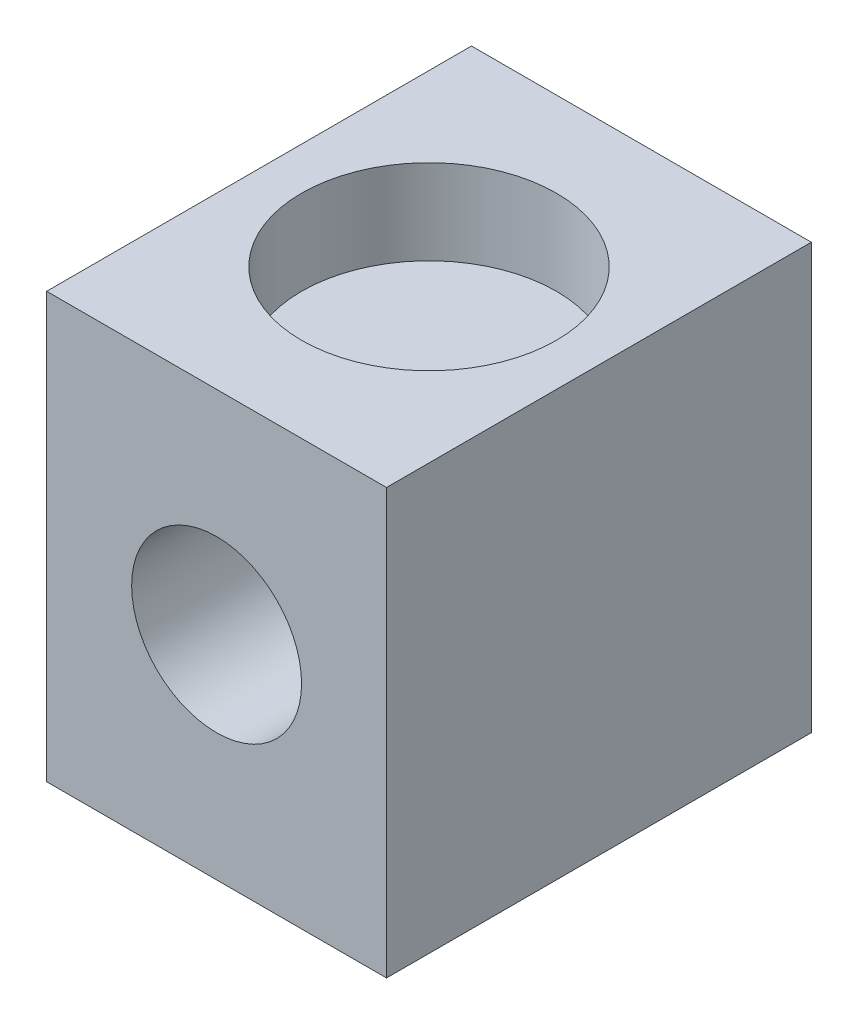
ISO-10303-21;
HEADER;
FILE_DESCRIPTION(('STEP AP214'),'2;1');
FILE_NAME('part.step','',(''),(''),'','','');
FILE_SCHEMA(('AUTOMOTIVE_DESIGN { 1 0 10303 214 1 1 1 1 }'));
ENDSEC;
DATA;
#1=APPLICATION_CONTEXT('core data for automotive mechanical design processes');
#2=APPLICATION_PROTOCOL_DEFINITION('international standard','automotive_design',2000,#1);
#3=PRODUCT_CONTEXT('',#1,'mechanical');
#4=PRODUCT('Part','Part','',(#3));
#5=PRODUCT_RELATED_PRODUCT_CATEGORY('part','',(#4));
#6=PRODUCT_DEFINITION_FORMATION('','',#4);
#7=PRODUCT_DEFINITION_CONTEXT('part definition',#1,'design');
#8=PRODUCT_DEFINITION('design','',#6,#7);
#9=PRODUCT_DEFINITION_SHAPE('','',#8);
#10=(LENGTH_UNIT() NAMED_UNIT(*) SI_UNIT(.MILLI.,.METRE.));
#11=(NAMED_UNIT(*) PLANE_ANGLE_UNIT() SI_UNIT($,.RADIAN.));
#12=(NAMED_UNIT(*) SI_UNIT($,.STERADIAN.) SOLID_ANGLE_UNIT());
#13=UNCERTAINTY_MEASURE_WITH_UNIT(LENGTH_MEASURE(1.E-05),#10,'distance_accuracy_value','');
#14=(GEOMETRIC_REPRESENTATION_CONTEXT(3) GLOBAL_UNCERTAINTY_ASSIGNED_CONTEXT((#13)) GLOBAL_UNIT_ASSIGNED_CONTEXT((#10,
#11,#12)) REPRESENTATION_CONTEXT('',''));
#15=CARTESIAN_POINT('',(0.,0.,0.));
#16=DIRECTION('',(0.,0.,1.));
#17=DIRECTION('',(1.,0.,0.));
#18=AXIS2_PLACEMENT_3D('',#15,#16,#17);
#19=CARTESIAN_POINT('',(0.,0.,5.));
#20=DIRECTION('',(0.,0.,-1.));
#21=DIRECTION('',(-1.,0.,0.));
#22=AXIS2_PLACEMENT_3D('',#19,#20,#21);
#23=PLANE('',#22);
#24=DIRECTION('',(0.,1.,0.));
#25=VECTOR('',#24,1.);
#26=CARTESIAN_POINT('',(2.,-2.5,5.));
#27=LINE('',#26,#25);
#28=CARTESIAN_POINT('',(2.,-2.5,5.));
#29=VERTEX_POINT('',#28);
#30=CARTESIAN_POINT('',(2.,2.5,5.));
#31=VERTEX_POINT('',#30);
#32=EDGE_CURVE('E92',#29,#31,#27,.T.);
#33=ORIENTED_EDGE('',*,*,#32,.T.);
#34=DIRECTION('',(-1.,0.,0.));
#35=VECTOR('',#34,1.);
#36=CARTESIAN_POINT('',(-2.,2.5,5.));
#37=LINE('',#36,#35);
#38=CARTESIAN_POINT('',(-2.,2.5,5.));
#39=VERTEX_POINT('',#38);
#40=EDGE_CURVE('E87',#31,#39,#37,.T.);
#41=ORIENTED_EDGE('',*,*,#40,.T.);
#42=DIRECTION('',(0.,-1.,0.));
#43=VECTOR('',#42,1.);
#44=CARTESIAN_POINT('',(-2.,-2.5,5.));
#45=LINE('',#44,#43);
#46=CARTESIAN_POINT('',(-2.,-2.5,5.));
#47=VERTEX_POINT('',#46);
#48=EDGE_CURVE('E90',#39,#47,#45,.T.);
#49=ORIENTED_EDGE('',*,*,#48,.T.);
#50=DIRECTION('',(1.,0.,0.));
#51=VECTOR('',#50,1.);
#52=CARTESIAN_POINT('',(-2.,-2.5,5.));
#53=LINE('',#52,#51);
#54=EDGE_CURVE('E57',#47,#29,#53,.T.);
#55=ORIENTED_EDGE('',*,*,#54,.T.);
#56=EDGE_LOOP('',(#33,#41,#49,#55));
#57=FACE_BOUND('',#56,.T.);
#58=CARTESIAN_POINT('',(0.,0.,5.));
#59=DIRECTION('',(0.,0.,1.));
#60=DIRECTION('',(1.,0.,0.));
#61=AXIS2_PLACEMENT_3D('',#58,#59,#60);
#62=CIRCLE('',#61,1.);
#63=CARTESIAN_POINT('',(1.,0.,5.));
#64=VERTEX_POINT('',#63);
#65=EDGE_CURVE('E112',#64,#64,#62,.T.);
#66=ORIENTED_EDGE('',*,*,#65,.F.);
#67=EDGE_LOOP('',(#66));
#68=FACE_BOUND('',#67,.T.);
#69=ADVANCED_FACE('F39',(#57,#68),#23,.F.);
#70=CARTESIAN_POINT('',(0.,0.,0.));
#71=DIRECTION('',(0.,0.,-1.));
#72=DIRECTION('',(-1.,0.,0.));
#73=AXIS2_PLACEMENT_3D('',#70,#71,#72);
#74=PLANE('',#73);
#75=DIRECTION('',(0.,1.,0.));
#76=VECTOR('',#75,1.);
#77=CARTESIAN_POINT('',(2.,-2.5,0.));
#78=LINE('',#77,#76);
#79=CARTESIAN_POINT('',(2.,-2.5,0.));
#80=VERTEX_POINT('',#79);
#81=CARTESIAN_POINT('',(2.,2.5,0.));
#82=VERTEX_POINT('',#81);
#83=EDGE_CURVE('E108',#80,#82,#78,.T.);
#84=ORIENTED_EDGE('',*,*,#83,.F.);
#85=DIRECTION('',(1.,0.,0.));
#86=VECTOR('',#85,1.);
#87=CARTESIAN_POINT('',(-2.,-2.5,0.));
#88=LINE('',#87,#86);
#89=CARTESIAN_POINT('',(-2.,-2.5,0.));
#90=VERTEX_POINT('',#89);
#91=EDGE_CURVE('E80',#90,#80,#88,.T.);
#92=ORIENTED_EDGE('',*,*,#91,.F.);
#93=DIRECTION('',(0.,-1.,0.));
#94=VECTOR('',#93,1.);
#95=CARTESIAN_POINT('',(-2.,-2.5,0.));
#96=LINE('',#95,#94);
#97=CARTESIAN_POINT('',(-2.,2.5,0.));
#98=VERTEX_POINT('',#97);
#99=EDGE_CURVE('E74',#98,#90,#96,.T.);
#100=ORIENTED_EDGE('',*,*,#99,.F.);
#101=DIRECTION('',(-1.,0.,0.));
#102=VECTOR('',#101,1.);
#103=CARTESIAN_POINT('',(-2.,2.5,0.));
#104=LINE('',#103,#102);
#105=EDGE_CURVE('E97',#82,#98,#104,.T.);
#106=ORIENTED_EDGE('',*,*,#105,.F.);
#107=EDGE_LOOP('',(#84,#92,#100,#106));
#108=FACE_BOUND('',#107,.T.);
#109=CARTESIAN_POINT('',(0.,0.,0.));
#110=DIRECTION('',(0.,0.,1.));
#111=DIRECTION('',(1.,0.,0.));
#112=AXIS2_PLACEMENT_3D('',#109,#110,#111);
#113=CIRCLE('',#112,1.);
#114=CARTESIAN_POINT('',(1.,0.,0.));
#115=VERTEX_POINT('',#114);
#116=EDGE_CURVE('E130',#115,#115,#113,.T.);
#117=ORIENTED_EDGE('',*,*,#116,.T.);
#118=EDGE_LOOP('',(#117));
#119=FACE_BOUND('',#118,.T.);
#120=ADVANCED_FACE('F125',(#108,#119),#74,.T.);
#121=CARTESIAN_POINT('',(2.,-2.5,5.));
#122=DIRECTION('',(-1.,0.,0.));
#123=DIRECTION('',(0.,0.,1.));
#124=AXIS2_PLACEMENT_3D('',#121,#122,#123);
#125=PLANE('',#124);
#126=ORIENTED_EDGE('',*,*,#83,.T.);
#127=DIRECTION('',(0.,0.,-1.));
#128=VECTOR('',#127,1.);
#129=CARTESIAN_POINT('',(2.,2.5,5.));
#130=LINE('',#129,#128);
#131=EDGE_CURVE('E11',#31,#82,#130,.T.);
#132=ORIENTED_EDGE('',*,*,#131,.F.);
#133=ORIENTED_EDGE('',*,*,#32,.F.);
#134=DIRECTION('',(0.,0.,-1.));
#135=VECTOR('',#134,1.);
#136=CARTESIAN_POINT('',(2.,-2.5,5.));
#137=LINE('',#136,#135);
#138=EDGE_CURVE('E104',#29,#80,#137,.T.);
#139=ORIENTED_EDGE('',*,*,#138,.T.);
#140=EDGE_LOOP('',(#126,#132,#133,#139));
#141=FACE_BOUND('',#140,.T.);
#142=ADVANCED_FACE('F41',(#141),#125,.F.);
#143=CARTESIAN_POINT('',(-2.,2.5,5.));
#144=DIRECTION('',(0.,-1.,0.));
#145=DIRECTION('',(0.,0.,-1.));
#146=AXIS2_PLACEMENT_3D('',#143,#144,#145);
#147=PLANE('',#146);
#148=CARTESIAN_POINT('',(0.,2.5,2.5));
#149=DIRECTION('',(0.,1.,0.));
#150=DIRECTION('',(0.,0.,1.));
#151=AXIS2_PLACEMENT_3D('',#148,#149,#150);
#152=CIRCLE('',#151,1.5);
#153=CARTESIAN_POINT('',(0.,2.5,4.));
#154=VERTEX_POINT('',#153);
#155=EDGE_CURVE('E138',#154,#154,#152,.T.);
#156=ORIENTED_EDGE('',*,*,#155,.F.);
#157=EDGE_LOOP('',(#156));
#158=FACE_BOUND('',#157,.T.);
#159=ORIENTED_EDGE('',*,*,#105,.T.);
#160=DIRECTION('',(0.,0.,-1.));
#161=VECTOR('',#160,1.);
#162=CARTESIAN_POINT('',(-2.,2.5,5.));
#163=LINE('',#162,#161);
#164=EDGE_CURVE('E49',#39,#98,#163,.T.);
#165=ORIENTED_EDGE('',*,*,#164,.F.);
#166=ORIENTED_EDGE('',*,*,#40,.F.);
#167=ORIENTED_EDGE('',*,*,#131,.T.);
#168=EDGE_LOOP('',(#159,#165,#166,#167));
#169=FACE_BOUND('',#168,.T.);
#170=ADVANCED_FACE('F96',(#158,#169),#147,.F.);
#171=CARTESIAN_POINT('',(-2.,-2.5,5.));
#172=DIRECTION('',(1.,0.,0.));
#173=DIRECTION('',(0.,0.,-1.));
#174=AXIS2_PLACEMENT_3D('',#171,#172,#173);
#175=PLANE('',#174);
#176=ORIENTED_EDGE('',*,*,#99,.T.);
#177=DIRECTION('',(0.,0.,-1.));
#178=VECTOR('',#177,1.);
#179=CARTESIAN_POINT('',(-2.,-2.5,5.));
#180=LINE('',#179,#178);
#181=EDGE_CURVE('E99',#47,#90,#180,.T.);
#182=ORIENTED_EDGE('',*,*,#181,.F.);
#183=ORIENTED_EDGE('',*,*,#48,.F.);
#184=ORIENTED_EDGE('',*,*,#164,.T.);
#185=EDGE_LOOP('',(#176,#182,#183,#184));
#186=FACE_BOUND('',#185,.T.);
#187=ADVANCED_FACE('F100',(#186),#175,.F.);
#188=CARTESIAN_POINT('',(-2.,-2.5,5.));
#189=DIRECTION('',(0.,1.,0.));
#190=DIRECTION('',(0.,0.,1.));
#191=AXIS2_PLACEMENT_3D('',#188,#189,#190);
#192=PLANE('',#191);
#193=CARTESIAN_POINT('',(0.,-2.5,2.5));
#194=DIRECTION('',(0.,1.,0.));
#195=DIRECTION('',(0.,0.,1.));
#196=AXIS2_PLACEMENT_3D('',#193,#194,#195);
#197=CIRCLE('',#196,1.5);
#198=CARTESIAN_POINT('',(0.,-2.5,4.));
#199=VERTEX_POINT('',#198);
#200=EDGE_CURVE('E146',#199,#199,#197,.T.);
#201=ORIENTED_EDGE('',*,*,#200,.T.);
#202=EDGE_LOOP('',(#201));
#203=FACE_BOUND('',#202,.T.);
#204=ORIENTED_EDGE('',*,*,#91,.T.);
#205=ORIENTED_EDGE('',*,*,#138,.F.);
#206=ORIENTED_EDGE('',*,*,#54,.F.);
#207=ORIENTED_EDGE('',*,*,#181,.T.);
#208=EDGE_LOOP('',(#204,#205,#206,#207));
#209=FACE_BOUND('',#208,.T.);
#210=ADVANCED_FACE('F122',(#203,#209),#192,.F.);
#211=CARTESIAN_POINT('',(0.,0.,5.));
#212=DIRECTION('',(0.,0.,-1.));
#213=DIRECTION('',(-1.,0.,0.));
#214=AXIS2_PLACEMENT_3D('',#211,#212,#213);
#215=CYLINDRICAL_SURFACE('',#214,1.);
#216=ORIENTED_EDGE('',*,*,#65,.T.);
#217=EDGE_LOOP('',(#216));
#218=FACE_BOUND('',#217,.T.);
#219=ORIENTED_EDGE('',*,*,#116,.F.);
#220=EDGE_LOOP('',(#219));
#221=FACE_BOUND('',#220,.T.);
#222=ADVANCED_FACE('F172',(#218,#221),#215,.F.);
#223=CARTESIAN_POINT('',(0.,1.5,2.5));
#224=DIRECTION('',(0.,1.,0.));
#225=DIRECTION('',(0.,0.,1.));
#226=AXIS2_PLACEMENT_3D('',#223,#224,#225);
#227=CYLINDRICAL_SURFACE('',#226,1.5);
#228=CARTESIAN_POINT('',(0.,1.5,2.5));
#229=DIRECTION('',(0.,1.,0.));
#230=DIRECTION('',(0.,0.,1.));
#231=AXIS2_PLACEMENT_3D('',#228,#229,#230);
#232=CIRCLE('',#231,1.5);
#233=CARTESIAN_POINT('',(0.,1.5,4.));
#234=VERTEX_POINT('',#233);
#235=EDGE_CURVE('E134',#234,#234,#232,.T.);
#236=ORIENTED_EDGE('',*,*,#235,.F.);
#237=EDGE_LOOP('',(#236));
#238=FACE_BOUND('',#237,.T.);
#239=ORIENTED_EDGE('',*,*,#155,.T.);
#240=EDGE_LOOP('',(#239));
#241=FACE_BOUND('',#240,.T.);
#242=ADVANCED_FACE('F186',(#238,#241),#227,.F.);
#243=CARTESIAN_POINT('',(0.,1.5,2.5));
#244=DIRECTION('',(0.,1.,0.));
#245=DIRECTION('',(0.,0.,1.));
#246=AXIS2_PLACEMENT_3D('',#243,#244,#245);
#247=PLANE('',#246);
#248=ORIENTED_EDGE('',*,*,#235,.T.);
#249=EDGE_LOOP('',(#248));
#250=FACE_BOUND('',#249,.T.);
#251=ADVANCED_FACE('F163',(#250),#247,.T.);
#252=CARTESIAN_POINT('',(0.,-1.5,2.5));
#253=DIRECTION('',(0.,-1.,0.));
#254=DIRECTION('',(0.,0.,-1.));
#255=AXIS2_PLACEMENT_3D('',#252,#253,#254);
#256=CYLINDRICAL_SURFACE('',#255,1.5);
#257=CARTESIAN_POINT('',(0.,-1.5,2.5));
#258=DIRECTION('',(0.,1.,0.));
#259=DIRECTION('',(0.,0.,1.));
#260=AXIS2_PLACEMENT_3D('',#257,#258,#259);
#261=CIRCLE('',#260,1.5);
#262=CARTESIAN_POINT('',(0.,-1.5,4.));
#263=VERTEX_POINT('',#262);
#264=EDGE_CURVE('E142',#263,#263,#261,.T.);
#265=ORIENTED_EDGE('',*,*,#264,.T.);
#266=EDGE_LOOP('',(#265));
#267=FACE_BOUND('',#266,.T.);
#268=ORIENTED_EDGE('',*,*,#200,.F.);
#269=EDGE_LOOP('',(#268));
#270=FACE_BOUND('',#269,.T.);
#271=ADVANCED_FACE('F154',(#267,#270),#256,.F.);
#272=CARTESIAN_POINT('',(0.,-1.5,2.5));
#273=DIRECTION('',(0.,-1.,0.));
#274=DIRECTION('',(0.,0.,1.));
#275=AXIS2_PLACEMENT_3D('',#272,#273,#274);
#276=PLANE('',#275);
#277=ORIENTED_EDGE('',*,*,#264,.F.);
#278=EDGE_LOOP('',(#277));
#279=FACE_BOUND('',#278,.T.);
#280=ADVANCED_FACE('F157',(#279),#276,.T.);
#281=CLOSED_SHELL('',(#69,#120,#142,#170,#187,#210,#222,#242,#251,#271,#280));
#282=MANIFOLD_SOLID_BREP('B2',#281);
#283=ADVANCED_BREP_SHAPE_REPRESENTATION('',(#18,#282),#14);
#284=SHAPE_DEFINITION_REPRESENTATION(#9,#283);
ENDSEC;
END-ISO-10303-21;
